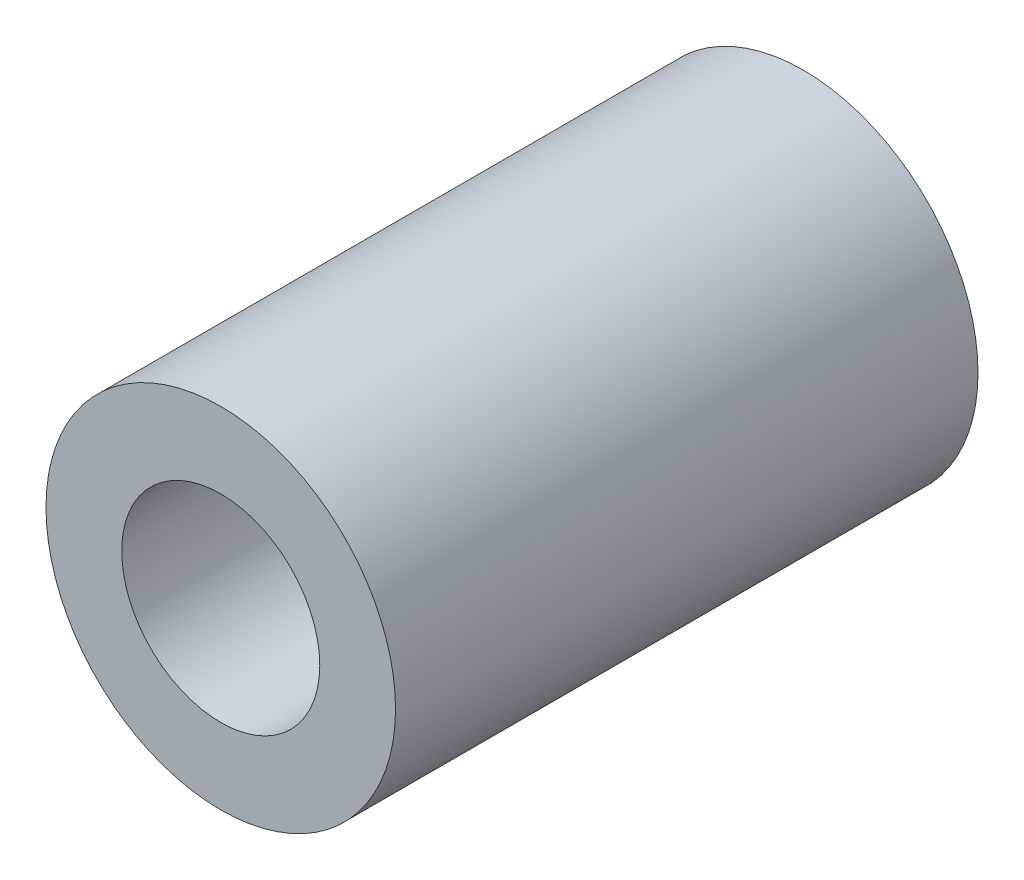
ISO-10303-21;
HEADER;
FILE_DESCRIPTION(('STEP AP214'),'2;1');
FILE_NAME('part.step','',(''),(''),'','','');
FILE_SCHEMA(('AUTOMOTIVE_DESIGN { 1 0 10303 214 1 1 1 1 }'));
ENDSEC;
DATA;
#1=APPLICATION_CONTEXT('core data for automotive mechanical design processes');
#2=APPLICATION_PROTOCOL_DEFINITION('international standard','automotive_design',2000,#1);
#3=PRODUCT_CONTEXT('',#1,'mechanical');
#4=PRODUCT('Part','Part','',(#3));
#5=PRODUCT_RELATED_PRODUCT_CATEGORY('part','',(#4));
#6=PRODUCT_DEFINITION_FORMATION('','',#4);
#7=PRODUCT_DEFINITION_CONTEXT('part definition',#1,'design');
#8=PRODUCT_DEFINITION('design','',#6,#7);
#9=PRODUCT_DEFINITION_SHAPE('','',#8);
#10=(LENGTH_UNIT() NAMED_UNIT(*) SI_UNIT(.MILLI.,.METRE.));
#11=(NAMED_UNIT(*) PLANE_ANGLE_UNIT() SI_UNIT($,.RADIAN.));
#12=(NAMED_UNIT(*) SI_UNIT($,.STERADIAN.) SOLID_ANGLE_UNIT());
#13=UNCERTAINTY_MEASURE_WITH_UNIT(LENGTH_MEASURE(1.E-05),#10,'distance_accuracy_value','');
#14=(GEOMETRIC_REPRESENTATION_CONTEXT(3) GLOBAL_UNCERTAINTY_ASSIGNED_CONTEXT((#13)) GLOBAL_UNIT_ASSIGNED_CONTEXT((#10,
#11,#12)) REPRESENTATION_CONTEXT('',''));
#15=CARTESIAN_POINT('',(0.,0.,0.));
#16=DIRECTION('',(0.,0.,1.));
#17=DIRECTION('',(1.,0.,0.));
#18=AXIS2_PLACEMENT_3D('',#15,#16,#17);
#19=CARTESIAN_POINT('',(-11.9027324487123,30.0594429636971,10.));
#20=DIRECTION('',(0.,0.,-1.));
#21=DIRECTION('',(-1.,0.,0.));
#22=AXIS2_PLACEMENT_3D('',#19,#20,#21);
#23=CYLINDRICAL_SURFACE('',#22,3.);
#24=CARTESIAN_POINT('',(-11.9027324487123,30.0594429636971,10.));
#25=DIRECTION('',(0.,0.,1.));
#26=DIRECTION('',(1.,0.,0.));
#27=AXIS2_PLACEMENT_3D('',#24,#25,#26);
#28=CIRCLE('',#27,3.);
#29=CARTESIAN_POINT('',(-8.90273244871227,30.0594429636971,10.));
#30=VERTEX_POINT('',#29);
#31=EDGE_CURVE('E10',#30,#30,#28,.T.);
#32=ORIENTED_EDGE('',*,*,#31,.F.);
#33=EDGE_LOOP('',(#32));
#34=FACE_BOUND('',#33,.T.);
#35=CARTESIAN_POINT('',(-11.9027324487123,30.0594429636971,0.));
#36=DIRECTION('',(0.,0.,1.));
#37=DIRECTION('',(1.,0.,0.));
#38=AXIS2_PLACEMENT_3D('',#35,#36,#37);
#39=CIRCLE('',#38,3.);
#40=CARTESIAN_POINT('',(-8.90273244871227,30.0594429636971,0.));
#41=VERTEX_POINT('',#40);
#42=EDGE_CURVE('E47',#41,#41,#39,.T.);
#43=ORIENTED_EDGE('',*,*,#42,.T.);
#44=EDGE_LOOP('',(#43));
#45=FACE_BOUND('',#44,.T.);
#46=ADVANCED_FACE('F44',(#34,#45),#23,.T.);
#47=CARTESIAN_POINT('',(-11.9027324487123,30.0594429636971,10.));
#48=DIRECTION('',(0.,0.,1.));
#49=DIRECTION('',(1.,0.,0.));
#50=AXIS2_PLACEMENT_3D('',#47,#48,#49);
#51=PLANE('',#50);
#52=CARTESIAN_POINT('',(-11.9027324487123,30.0594429636971,10.));
#53=DIRECTION('',(0.,0.,1.));
#54=DIRECTION('',(1.,0.,0.));
#55=AXIS2_PLACEMENT_3D('',#52,#53,#54);
#56=CIRCLE('',#55,1.7);
#57=CARTESIAN_POINT('',(-10.2027324487123,30.0594429636971,10.));
#58=VERTEX_POINT('',#57);
#59=EDGE_CURVE('E59',#58,#58,#56,.T.);
#60=ORIENTED_EDGE('',*,*,#59,.F.);
#61=EDGE_LOOP('',(#60));
#62=FACE_BOUND('',#61,.T.);
#63=ORIENTED_EDGE('',*,*,#31,.T.);
#64=EDGE_LOOP('',(#63));
#65=FACE_BOUND('',#64,.T.);
#66=ADVANCED_FACE('F77',(#62,#65),#51,.T.);
#67=CARTESIAN_POINT('',(-11.9027324487123,30.0594429636971,0.));
#68=DIRECTION('',(0.,0.,1.));
#69=DIRECTION('',(1.,0.,0.));
#70=AXIS2_PLACEMENT_3D('',#67,#68,#69);
#71=PLANE('',#70);
#72=CARTESIAN_POINT('',(-11.9027324487123,30.0594429636971,0.));
#73=DIRECTION('',(0.,0.,1.));
#74=DIRECTION('',(1.,0.,0.));
#75=AXIS2_PLACEMENT_3D('',#72,#73,#74);
#76=CIRCLE('',#75,1.7);
#77=CARTESIAN_POINT('',(-10.2027324487123,30.0594429636971,0.));
#78=VERTEX_POINT('',#77);
#79=EDGE_CURVE('E57',#78,#78,#76,.T.);
#80=ORIENTED_EDGE('',*,*,#79,.T.);
#81=EDGE_LOOP('',(#80));
#82=FACE_BOUND('',#81,.T.);
#83=ORIENTED_EDGE('',*,*,#42,.F.);
#84=EDGE_LOOP('',(#83));
#85=FACE_BOUND('',#84,.T.);
#86=ADVANCED_FACE('F68',(#82,#85),#71,.F.);
#87=CARTESIAN_POINT('',(-11.9027324487123,30.0594429636971,0.));
#88=DIRECTION('',(0.,0.,1.));
#89=DIRECTION('',(1.,0.,0.));
#90=AXIS2_PLACEMENT_3D('',#87,#88,#89);
#91=CYLINDRICAL_SURFACE('',#90,1.7);
#92=ORIENTED_EDGE('',*,*,#79,.F.);
#93=EDGE_LOOP('',(#92));
#94=FACE_BOUND('',#93,.T.);
#95=ORIENTED_EDGE('',*,*,#59,.T.);
#96=EDGE_LOOP('',(#95));
#97=FACE_BOUND('',#96,.T.);
#98=ADVANCED_FACE('F71',(#94,#97),#91,.F.);
#99=CLOSED_SHELL('',(#46,#66,#86,#98));
#100=MANIFOLD_SOLID_BREP('B2',#99);
#101=ADVANCED_BREP_SHAPE_REPRESENTATION('',(#18,#100),#14);
#102=SHAPE_DEFINITION_REPRESENTATION(#9,#101);
ENDSEC;
END-ISO-10303-21;
